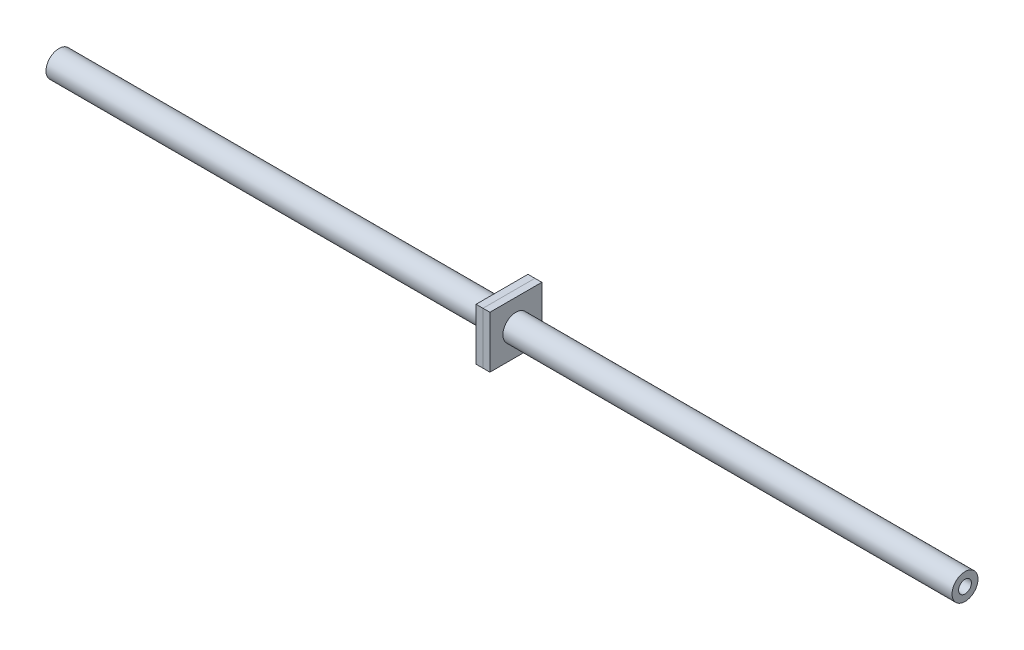
ISO-10303-21;
HEADER;
FILE_DESCRIPTION(('STEP AP214'),'2;1');
FILE_NAME('part.step','',(''),(''),'','','');
FILE_SCHEMA(('AUTOMOTIVE_DESIGN { 1 0 10303 214 1 1 1 1 }'));
ENDSEC;
DATA;
#1=APPLICATION_CONTEXT('core data for automotive mechanical design processes');
#2=APPLICATION_PROTOCOL_DEFINITION('international standard','automotive_design',2000,#1);
#3=PRODUCT_CONTEXT('',#1,'mechanical');
#4=PRODUCT('Part','Part','',(#3));
#5=PRODUCT_RELATED_PRODUCT_CATEGORY('part','',(#4));
#6=PRODUCT_DEFINITION_FORMATION('','',#4);
#7=PRODUCT_DEFINITION_CONTEXT('part definition',#1,'design');
#8=PRODUCT_DEFINITION('design','',#6,#7);
#9=PRODUCT_DEFINITION_SHAPE('','',#8);
#10=(LENGTH_UNIT() NAMED_UNIT(*) SI_UNIT(.MILLI.,.METRE.));
#11=(NAMED_UNIT(*) PLANE_ANGLE_UNIT() SI_UNIT($,.RADIAN.));
#12=(NAMED_UNIT(*) SI_UNIT($,.STERADIAN.) SOLID_ANGLE_UNIT());
#13=UNCERTAINTY_MEASURE_WITH_UNIT(LENGTH_MEASURE(1.E-05),#10,'distance_accuracy_value','');
#14=(GEOMETRIC_REPRESENTATION_CONTEXT(3) GLOBAL_UNCERTAINTY_ASSIGNED_CONTEXT((#13)) GLOBAL_UNIT_ASSIGNED_CONTEXT((#10,
#11,#12)) REPRESENTATION_CONTEXT('',''));
#15=CARTESIAN_POINT('',(0.,0.,0.));
#16=DIRECTION('',(0.,0.,1.));
#17=DIRECTION('',(1.,0.,0.));
#18=AXIS2_PLACEMENT_3D('',#15,#16,#17);
#19=CARTESIAN_POINT('',(162.56,0.,0.));
#20=DIRECTION('',(1.,0.,0.));
#21=DIRECTION('',(0.,0.,-1.));
#22=AXIS2_PLACEMENT_3D('',#19,#20,#21);
#23=PLANE('',#22);
#24=DIRECTION('',(0.,1.,0.));
#25=VECTOR('',#24,1.);
#26=CARTESIAN_POINT('',(162.56,0.,-9.525));
#27=LINE('',#26,#25);
#28=CARTESIAN_POINT('',(162.56,-9.525,-9.525));
#29=VERTEX_POINT('',#28);
#30=CARTESIAN_POINT('',(162.56,9.525,-9.525));
#31=VERTEX_POINT('',#30);
#32=EDGE_CURVE('E114',#29,#31,#27,.T.);
#33=ORIENTED_EDGE('',*,*,#32,.F.);
#34=DIRECTION('',(0.,0.,-1.));
#35=VECTOR('',#34,1.);
#36=CARTESIAN_POINT('',(162.56,-9.525,0.));
#37=LINE('',#36,#35);
#38=CARTESIAN_POINT('',(162.56,-9.525,9.525));
#39=VERTEX_POINT('',#38);
#40=EDGE_CURVE('E111',#39,#29,#37,.T.);
#41=ORIENTED_EDGE('',*,*,#40,.F.);
#42=DIRECTION('',(0.,-1.,0.));
#43=VECTOR('',#42,1.);
#44=CARTESIAN_POINT('',(162.56,0.,9.525));
#45=LINE('',#44,#43);
#46=CARTESIAN_POINT('',(162.56,9.525,9.525));
#47=VERTEX_POINT('',#46);
#48=EDGE_CURVE('E104',#47,#39,#45,.T.);
#49=ORIENTED_EDGE('',*,*,#48,.F.);
#50=DIRECTION('',(0.,0.,1.));
#51=VECTOR('',#50,1.);
#52=CARTESIAN_POINT('',(162.56,9.525,0.));
#53=LINE('',#52,#51);
#54=EDGE_CURVE('E110',#31,#47,#53,.T.);
#55=ORIENTED_EDGE('',*,*,#54,.F.);
#56=EDGE_LOOP('',(#33,#41,#49,#55));
#57=FACE_BOUND('',#56,.T.);
#58=CARTESIAN_POINT('',(162.56,0.,0.));
#59=DIRECTION('',(-1.,0.,0.));
#60=DIRECTION('',(0.,0.,1.));
#61=AXIS2_PLACEMENT_3D('',#58,#59,#60);
#62=CIRCLE('',#61,4.7625);
#63=CARTESIAN_POINT('',(162.56,0.,4.7625));
#64=VERTEX_POINT('',#63);
#65=EDGE_CURVE('E125',#64,#64,#62,.T.);
#66=ORIENTED_EDGE('',*,*,#65,.F.);
#67=EDGE_LOOP('',(#66));
#68=FACE_BOUND('',#67,.T.);
#69=ADVANCED_FACE('F55',(#57,#68),#23,.F.);
#70=CARTESIAN_POINT('',(165.1,0.,0.));
#71=DIRECTION('',(1.,0.,0.));
#72=DIRECTION('',(0.,0.,-1.));
#73=AXIS2_PLACEMENT_3D('',#70,#71,#72);
#74=PLANE('',#73);
#75=DIRECTION('',(0.,1.,0.));
#76=VECTOR('',#75,1.);
#77=CARTESIAN_POINT('',(165.1,0.,-9.525));
#78=LINE('',#77,#76);
#79=CARTESIAN_POINT('',(165.1,-9.525,-9.525));
#80=VERTEX_POINT('',#79);
#81=CARTESIAN_POINT('',(165.1,9.525,-9.525));
#82=VERTEX_POINT('',#81);
#83=EDGE_CURVE('E121',#80,#82,#78,.T.);
#84=ORIENTED_EDGE('',*,*,#83,.T.);
#85=DIRECTION('',(0.,0.,1.));
#86=VECTOR('',#85,1.);
#87=CARTESIAN_POINT('',(165.1,9.525,0.));
#88=LINE('',#87,#86);
#89=CARTESIAN_POINT('',(165.1,9.525,9.525));
#90=VERTEX_POINT('',#89);
#91=EDGE_CURVE('E124',#82,#90,#88,.T.);
#92=ORIENTED_EDGE('',*,*,#91,.T.);
#93=DIRECTION('',(0.,-1.,0.));
#94=VECTOR('',#93,1.);
#95=CARTESIAN_POINT('',(165.1,0.,9.525));
#96=LINE('',#95,#94);
#97=CARTESIAN_POINT('',(165.1,-9.525,9.525));
#98=VERTEX_POINT('',#97);
#99=EDGE_CURVE('E106',#90,#98,#96,.T.);
#100=ORIENTED_EDGE('',*,*,#99,.T.);
#101=DIRECTION('',(0.,0.,-1.));
#102=VECTOR('',#101,1.);
#103=CARTESIAN_POINT('',(165.1,-9.525,0.));
#104=LINE('',#103,#102);
#105=EDGE_CURVE('E116',#98,#80,#104,.T.);
#106=ORIENTED_EDGE('',*,*,#105,.T.);
#107=EDGE_LOOP('',(#84,#92,#100,#106));
#108=FACE_BOUND('',#107,.T.);
#109=CARTESIAN_POINT('',(165.1,0.,0.));
#110=DIRECTION('',(-1.,0.,0.));
#111=DIRECTION('',(0.,0.,1.));
#112=AXIS2_PLACEMENT_3D('',#109,#110,#111);
#113=CIRCLE('',#112,4.7625);
#114=CARTESIAN_POINT('',(165.1,0.,4.7625));
#115=VERTEX_POINT('',#114);
#116=EDGE_CURVE('E159',#115,#115,#113,.T.);
#117=ORIENTED_EDGE('',*,*,#116,.T.);
#118=EDGE_LOOP('',(#117));
#119=FACE_BOUND('',#118,.T.);
#120=ADVANCED_FACE('F131',(#108,#119),#74,.T.);
#121=CARTESIAN_POINT('',(162.56,0.,-9.525));
#122=DIRECTION('',(0.,0.,-1.));
#123=DIRECTION('',(0.,1.,0.));
#124=AXIS2_PLACEMENT_3D('',#121,#122,#123);
#125=PLANE('',#124);
#126=ORIENTED_EDGE('',*,*,#83,.F.);
#127=DIRECTION('',(1.,0.,0.));
#128=VECTOR('',#127,1.);
#129=CARTESIAN_POINT('',(162.56,-9.525,-9.525));
#130=LINE('',#129,#128);
#131=EDGE_CURVE('E13',#29,#80,#130,.T.);
#132=ORIENTED_EDGE('',*,*,#131,.F.);
#133=ORIENTED_EDGE('',*,*,#32,.T.);
#134=DIRECTION('',(1.,0.,0.));
#135=VECTOR('',#134,1.);
#136=CARTESIAN_POINT('',(162.56,9.525,-9.525));
#137=LINE('',#136,#135);
#138=EDGE_CURVE('E59',#31,#82,#137,.T.);
#139=ORIENTED_EDGE('',*,*,#138,.T.);
#140=EDGE_LOOP('',(#126,#132,#133,#139));
#141=FACE_BOUND('',#140,.T.);
#142=ADVANCED_FACE('F57',(#141),#125,.T.);
#143=CARTESIAN_POINT('',(162.56,-9.525,0.));
#144=DIRECTION('',(0.,-1.,0.));
#145=DIRECTION('',(0.,0.,-1.));
#146=AXIS2_PLACEMENT_3D('',#143,#144,#145);
#147=PLANE('',#146);
#148=ORIENTED_EDGE('',*,*,#105,.F.);
#149=DIRECTION('',(1.,0.,0.));
#150=VECTOR('',#149,1.);
#151=CARTESIAN_POINT('',(162.56,-9.525,9.525));
#152=LINE('',#151,#150);
#153=EDGE_CURVE('E65',#39,#98,#152,.T.);
#154=ORIENTED_EDGE('',*,*,#153,.F.);
#155=ORIENTED_EDGE('',*,*,#40,.T.);
#156=ORIENTED_EDGE('',*,*,#131,.T.);
#157=EDGE_LOOP('',(#148,#154,#155,#156));
#158=FACE_BOUND('',#157,.T.);
#159=ADVANCED_FACE('F133',(#158),#147,.T.);
#160=CARTESIAN_POINT('',(162.56,0.,9.525));
#161=DIRECTION('',(0.,0.,1.));
#162=DIRECTION('',(0.,-1.,0.));
#163=AXIS2_PLACEMENT_3D('',#160,#161,#162);
#164=PLANE('',#163);
#165=ORIENTED_EDGE('',*,*,#99,.F.);
#166=DIRECTION('',(1.,0.,0.));
#167=VECTOR('',#166,1.);
#168=CARTESIAN_POINT('',(162.56,9.525,9.525));
#169=LINE('',#168,#167);
#170=EDGE_CURVE('E101',#47,#90,#169,.T.);
#171=ORIENTED_EDGE('',*,*,#170,.F.);
#172=ORIENTED_EDGE('',*,*,#48,.T.);
#173=ORIENTED_EDGE('',*,*,#153,.T.);
#174=EDGE_LOOP('',(#165,#171,#172,#173));
#175=FACE_BOUND('',#174,.T.);
#176=ADVANCED_FACE('F103',(#175),#164,.T.);
#177=CARTESIAN_POINT('',(162.56,9.525,0.));
#178=DIRECTION('',(0.,1.,0.));
#179=DIRECTION('',(0.,0.,1.));
#180=AXIS2_PLACEMENT_3D('',#177,#178,#179);
#181=PLANE('',#180);
#182=ORIENTED_EDGE('',*,*,#91,.F.);
#183=ORIENTED_EDGE('',*,*,#138,.F.);
#184=ORIENTED_EDGE('',*,*,#54,.T.);
#185=ORIENTED_EDGE('',*,*,#170,.T.);
#186=EDGE_LOOP('',(#182,#183,#184,#185));
#187=FACE_BOUND('',#186,.T.);
#188=ADVANCED_FACE('F113',(#187),#181,.T.);
#189=CARTESIAN_POINT('',(162.56,0.,0.));
#190=DIRECTION('',(1.,0.,0.));
#191=DIRECTION('',(0.,0.,-1.));
#192=AXIS2_PLACEMENT_3D('',#189,#190,#191);
#193=CYLINDRICAL_SURFACE('',#192,4.7625);
#194=ORIENTED_EDGE('',*,*,#65,.T.);
#195=EDGE_LOOP('',(#194));
#196=FACE_BOUND('',#195,.T.);
#197=ORIENTED_EDGE('',*,*,#116,.F.);
#198=EDGE_LOOP('',(#197));
#199=FACE_BOUND('',#198,.T.);
#200=ADVANCED_FACE('F148',(#196,#199),#193,.F.);
#201=CLOSED_SHELL('',(#69,#120,#142,#159,#176,#188,#200));
#202=MANIFOLD_SOLID_BREP('B2',#201);
#203=CARTESIAN_POINT('',(167.64,0.,0.));
#204=DIRECTION('',(-1.,0.,0.));
#205=DIRECTION('',(0.,0.,1.));
#206=AXIS2_PLACEMENT_3D('',#203,#204,#205);
#207=PLANE('',#206);
#208=DIRECTION('',(0.,-1.,0.));
#209=VECTOR('',#208,1.);
#210=CARTESIAN_POINT('',(167.64,9.525,9.525));
#211=LINE('',#210,#209);
#212=CARTESIAN_POINT('',(167.64,9.525,9.525));
#213=VERTEX_POINT('',#212);
#214=CARTESIAN_POINT('',(167.64,-9.525,9.525));
#215=VERTEX_POINT('',#214);
#216=EDGE_CURVE('E259',#213,#215,#211,.T.);
#217=ORIENTED_EDGE('',*,*,#216,.T.);
#218=DIRECTION('',(0.,0.,-1.));
#219=VECTOR('',#218,1.);
#220=CARTESIAN_POINT('',(167.64,-9.525,-9.525));
#221=LINE('',#220,#219);
#222=CARTESIAN_POINT('',(167.64,-9.525,-9.525));
#223=VERTEX_POINT('',#222);
#224=EDGE_CURVE('E254',#215,#223,#221,.T.);
#225=ORIENTED_EDGE('',*,*,#224,.T.);
#226=DIRECTION('',(0.,1.,0.));
#227=VECTOR('',#226,1.);
#228=CARTESIAN_POINT('',(167.64,9.525,-9.525));
#229=LINE('',#228,#227);
#230=CARTESIAN_POINT('',(167.64,9.525,-9.525));
#231=VERTEX_POINT('',#230);
#232=EDGE_CURVE('E257',#223,#231,#229,.T.);
#233=ORIENTED_EDGE('',*,*,#232,.T.);
#234=DIRECTION('',(0.,0.,1.));
#235=VECTOR('',#234,1.);
#236=CARTESIAN_POINT('',(167.64,9.525,-9.525));
#237=LINE('',#236,#235);
#238=EDGE_CURVE('E224',#231,#213,#237,.T.);
#239=ORIENTED_EDGE('',*,*,#238,.T.);
#240=EDGE_LOOP('',(#217,#225,#233,#239));
#241=FACE_BOUND('',#240,.T.);
#242=CARTESIAN_POINT('',(167.64,0.,0.));
#243=DIRECTION('',(1.,0.,0.));
#244=DIRECTION('',(0.,0.,-1.));
#245=AXIS2_PLACEMENT_3D('',#242,#243,#244);
#246=CIRCLE('',#245,4.7625);
#247=CARTESIAN_POINT('',(167.64,0.,-4.7625));
#248=VERTEX_POINT('',#247);
#249=EDGE_CURVE('E274',#248,#248,#246,.T.);
#250=ORIENTED_EDGE('',*,*,#249,.F.);
#251=EDGE_LOOP('',(#250));
#252=FACE_BOUND('',#251,.T.);
#253=ADVANCED_FACE('F207',(#241,#252),#207,.F.);
#254=CARTESIAN_POINT('',(165.1,0.,0.));
#255=DIRECTION('',(-1.,0.,0.));
#256=DIRECTION('',(0.,0.,1.));
#257=AXIS2_PLACEMENT_3D('',#254,#255,#256);
#258=PLANE('',#257);
#259=DIRECTION('',(0.,-1.,0.));
#260=VECTOR('',#259,1.);
#261=CARTESIAN_POINT('',(165.1,9.525,9.525));
#262=LINE('',#261,#260);
#263=CARTESIAN_POINT('',(165.1,9.525,9.525));
#264=VERTEX_POINT('',#263);
#265=CARTESIAN_POINT('',(165.1,-9.525,9.525));
#266=VERTEX_POINT('',#265);
#267=EDGE_CURVE('E271',#264,#266,#262,.T.);
#268=ORIENTED_EDGE('',*,*,#267,.F.);
#269=DIRECTION('',(0.,0.,1.));
#270=VECTOR('',#269,1.);
#271=CARTESIAN_POINT('',(165.1,9.525,-9.525));
#272=LINE('',#271,#270);
#273=CARTESIAN_POINT('',(165.1,9.525,-9.525));
#274=VERTEX_POINT('',#273);
#275=EDGE_CURVE('E247',#274,#264,#272,.T.);
#276=ORIENTED_EDGE('',*,*,#275,.F.);
#277=DIRECTION('',(0.,1.,0.));
#278=VECTOR('',#277,1.);
#279=CARTESIAN_POINT('',(165.1,9.525,-9.525));
#280=LINE('',#279,#278);
#281=CARTESIAN_POINT('',(165.1,-9.525,-9.525));
#282=VERTEX_POINT('',#281);
#283=EDGE_CURVE('E241',#282,#274,#280,.T.);
#284=ORIENTED_EDGE('',*,*,#283,.F.);
#285=DIRECTION('',(0.,0.,-1.));
#286=VECTOR('',#285,1.);
#287=CARTESIAN_POINT('',(165.1,-9.525,-9.525));
#288=LINE('',#287,#286);
#289=EDGE_CURVE('E263',#266,#282,#288,.T.);
#290=ORIENTED_EDGE('',*,*,#289,.F.);
#291=EDGE_LOOP('',(#268,#276,#284,#290));
#292=FACE_BOUND('',#291,.T.);
#293=CARTESIAN_POINT('',(165.1,0.,0.));
#294=DIRECTION('',(1.,0.,0.));
#295=DIRECTION('',(0.,0.,-1.));
#296=AXIS2_PLACEMENT_3D('',#293,#294,#295);
#297=CIRCLE('',#296,4.7625);
#298=CARTESIAN_POINT('',(165.1,0.,-4.7625));
#299=VERTEX_POINT('',#298);
#300=EDGE_CURVE('E286',#299,#299,#297,.T.);
#301=ORIENTED_EDGE('',*,*,#300,.T.);
#302=EDGE_LOOP('',(#301));
#303=FACE_BOUND('',#302,.T.);
#304=ADVANCED_FACE('F282',(#292,#303),#258,.T.);
#305=CARTESIAN_POINT('',(167.64,9.525,9.525));
#306=DIRECTION('',(0.,0.,-1.));
#307=DIRECTION('',(0.,1.,0.));
#308=AXIS2_PLACEMENT_3D('',#305,#306,#307);
#309=PLANE('',#308);
#310=ORIENTED_EDGE('',*,*,#267,.T.);
#311=DIRECTION('',(-1.,0.,0.));
#312=VECTOR('',#311,1.);
#313=CARTESIAN_POINT('',(167.64,-9.525,9.525));
#314=LINE('',#313,#312);
#315=EDGE_CURVE('E53',#215,#266,#314,.T.);
#316=ORIENTED_EDGE('',*,*,#315,.F.);
#317=ORIENTED_EDGE('',*,*,#216,.F.);
#318=DIRECTION('',(-1.,0.,0.));
#319=VECTOR('',#318,1.);
#320=CARTESIAN_POINT('',(167.64,9.525,9.525));
#321=LINE('',#320,#319);
#322=EDGE_CURVE('E267',#213,#264,#321,.T.);
#323=ORIENTED_EDGE('',*,*,#322,.T.);
#324=EDGE_LOOP('',(#310,#316,#317,#323));
#325=FACE_BOUND('',#324,.T.);
#326=ADVANCED_FACE('F209',(#325),#309,.F.);
#327=CARTESIAN_POINT('',(167.64,-9.525,-9.525));
#328=DIRECTION('',(0.,1.,0.));
#329=DIRECTION('',(0.,0.,1.));
#330=AXIS2_PLACEMENT_3D('',#327,#328,#329);
#331=PLANE('',#330);
#332=ORIENTED_EDGE('',*,*,#289,.T.);
#333=DIRECTION('',(-1.,0.,0.));
#334=VECTOR('',#333,1.);
#335=CARTESIAN_POINT('',(167.64,-9.525,-9.525));
#336=LINE('',#335,#334);
#337=EDGE_CURVE('E216',#223,#282,#336,.T.);
#338=ORIENTED_EDGE('',*,*,#337,.F.);
#339=ORIENTED_EDGE('',*,*,#224,.F.);
#340=ORIENTED_EDGE('',*,*,#315,.T.);
#341=EDGE_LOOP('',(#332,#338,#339,#340));
#342=FACE_BOUND('',#341,.T.);
#343=ADVANCED_FACE('F262',(#342),#331,.F.);
#344=CARTESIAN_POINT('',(167.64,9.525,-9.525));
#345=DIRECTION('',(0.,0.,1.));
#346=DIRECTION('',(0.,-1.,0.));
#347=AXIS2_PLACEMENT_3D('',#344,#345,#346);
#348=PLANE('',#347);
#349=ORIENTED_EDGE('',*,*,#283,.T.);
#350=DIRECTION('',(-1.,0.,0.));
#351=VECTOR('',#350,1.);
#352=CARTESIAN_POINT('',(167.64,9.525,-9.525));
#353=LINE('',#352,#351);
#354=EDGE_CURVE('E264',#231,#274,#353,.T.);
#355=ORIENTED_EDGE('',*,*,#354,.F.);
#356=ORIENTED_EDGE('',*,*,#232,.F.);
#357=ORIENTED_EDGE('',*,*,#337,.T.);
#358=EDGE_LOOP('',(#349,#355,#356,#357));
#359=FACE_BOUND('',#358,.T.);
#360=ADVANCED_FACE('F265',(#359),#348,.F.);
#361=CARTESIAN_POINT('',(167.64,9.525,-9.525));
#362=DIRECTION('',(0.,-1.,0.));
#363=DIRECTION('',(0.,0.,-1.));
#364=AXIS2_PLACEMENT_3D('',#361,#362,#363);
#365=PLANE('',#364);
#366=ORIENTED_EDGE('',*,*,#275,.T.);
#367=ORIENTED_EDGE('',*,*,#322,.F.);
#368=ORIENTED_EDGE('',*,*,#238,.F.);
#369=ORIENTED_EDGE('',*,*,#354,.T.);
#370=EDGE_LOOP('',(#366,#367,#368,#369));
#371=FACE_BOUND('',#370,.T.);
#372=ADVANCED_FACE('F279',(#371),#365,.F.);
#373=CARTESIAN_POINT('',(167.64,0.,0.));
#374=DIRECTION('',(-1.,0.,0.));
#375=DIRECTION('',(0.,0.,1.));
#376=AXIS2_PLACEMENT_3D('',#373,#374,#375);
#377=CYLINDRICAL_SURFACE('',#376,4.7625);
#378=ORIENTED_EDGE('',*,*,#249,.T.);
#379=EDGE_LOOP('',(#378));
#380=FACE_BOUND('',#379,.T.);
#381=ORIENTED_EDGE('',*,*,#300,.F.);
#382=EDGE_LOOP('',(#381));
#383=FACE_BOUND('',#382,.T.);
#384=ADVANCED_FACE('F292',(#380,#383),#377,.F.);
#385=CLOSED_SHELL('',(#253,#304,#326,#343,#360,#372,#384));
#386=MANIFOLD_SOLID_BREP('B7',#385);
#387=CARTESIAN_POINT('',(332.4405,0.,0.));
#388=DIRECTION('',(-1.,0.,0.));
#389=DIRECTION('',(0.,0.,1.));
#390=AXIS2_PLACEMENT_3D('',#387,#388,#389);
#391=CYLINDRICAL_SURFACE('',#390,2.3495);
#392=CARTESIAN_POINT('',(332.4405,0.,0.));
#393=DIRECTION('',(1.,0.,0.));
#394=DIRECTION('',(0.,0.,-1.));
#395=AXIS2_PLACEMENT_3D('',#392,#393,#394);
#396=CIRCLE('',#395,2.3495);
#397=CARTESIAN_POINT('',(332.4405,0.,-2.3495));
#398=VERTEX_POINT('',#397);
#399=EDGE_CURVE('E344',#398,#398,#396,.T.);
#400=ORIENTED_EDGE('',*,*,#399,.T.);
#401=EDGE_LOOP('',(#400));
#402=FACE_BOUND('',#401,.T.);
#403=CARTESIAN_POINT('',(0.,0.,0.));
#404=DIRECTION('',(1.,0.,0.));
#405=DIRECTION('',(0.,0.,-1.));
#406=AXIS2_PLACEMENT_3D('',#403,#404,#405);
#407=CIRCLE('',#406,2.3495);
#408=CARTESIAN_POINT('',(0.,0.,-2.3495));
#409=VERTEX_POINT('',#408);
#410=EDGE_CURVE('E350',#409,#409,#407,.T.);
#411=ORIENTED_EDGE('',*,*,#410,.F.);
#412=EDGE_LOOP('',(#411));
#413=FACE_BOUND('',#412,.T.);
#414=ADVANCED_FACE('F337',(#402,#413),#391,.F.);
#415=CARTESIAN_POINT('',(332.4405,0.,0.));
#416=DIRECTION('',(-1.,0.,0.));
#417=DIRECTION('',(0.,0.,1.));
#418=AXIS2_PLACEMENT_3D('',#415,#416,#417);
#419=CYLINDRICAL_SURFACE('',#418,4.7625);
#420=CARTESIAN_POINT('',(332.4405,0.,0.));
#421=DIRECTION('',(1.,0.,0.));
#422=DIRECTION('',(0.,0.,-1.));
#423=AXIS2_PLACEMENT_3D('',#420,#421,#422);
#424=CIRCLE('',#423,4.7625);
#425=CARTESIAN_POINT('',(332.4405,0.,-4.7625));
#426=VERTEX_POINT('',#425);
#427=EDGE_CURVE('E206',#426,#426,#424,.T.);
#428=ORIENTED_EDGE('',*,*,#427,.F.);
#429=EDGE_LOOP('',(#428));
#430=FACE_BOUND('',#429,.T.);
#431=CARTESIAN_POINT('',(0.,0.,0.));
#432=DIRECTION('',(1.,0.,0.));
#433=DIRECTION('',(0.,0.,-1.));
#434=AXIS2_PLACEMENT_3D('',#431,#432,#433);
#435=CIRCLE('',#434,4.7625);
#436=CARTESIAN_POINT('',(0.,0.,-4.7625));
#437=VERTEX_POINT('',#436);
#438=EDGE_CURVE('E340',#437,#437,#435,.T.);
#439=ORIENTED_EDGE('',*,*,#438,.T.);
#440=EDGE_LOOP('',(#439));
#441=FACE_BOUND('',#440,.T.);
#442=ADVANCED_FACE('F357',(#430,#441),#419,.T.);
#443=CARTESIAN_POINT('',(332.4405,0.,0.));
#444=DIRECTION('',(1.,0.,0.));
#445=DIRECTION('',(0.,0.,-1.));
#446=AXIS2_PLACEMENT_3D('',#443,#444,#445);
#447=PLANE('',#446);
#448=ORIENTED_EDGE('',*,*,#399,.F.);
#449=EDGE_LOOP('',(#448));
#450=FACE_BOUND('',#449,.T.);
#451=ORIENTED_EDGE('',*,*,#427,.T.);
#452=EDGE_LOOP('',(#451));
#453=FACE_BOUND('',#452,.T.);
#454=ADVANCED_FACE('F361',(#450,#453),#447,.T.);
#455=CARTESIAN_POINT('',(0.,0.,0.));
#456=DIRECTION('',(1.,0.,0.));
#457=DIRECTION('',(0.,0.,-1.));
#458=AXIS2_PLACEMENT_3D('',#455,#456,#457);
#459=PLANE('',#458);
#460=ORIENTED_EDGE('',*,*,#410,.T.);
#461=EDGE_LOOP('',(#460));
#462=FACE_BOUND('',#461,.T.);
#463=ORIENTED_EDGE('',*,*,#438,.F.);
#464=EDGE_LOOP('',(#463));
#465=FACE_BOUND('',#464,.T.);
#466=ADVANCED_FACE('F359',(#462,#465),#459,.F.);
#467=CLOSED_SHELL('',(#414,#442,#454,#466));
#468=MANIFOLD_SOLID_BREP('B47',#467);
#469=ADVANCED_BREP_SHAPE_REPRESENTATION('',(#18,#202,#386,#468),#14);
#470=SHAPE_DEFINITION_REPRESENTATION(#9,#469);
ENDSEC;
END-ISO-10303-21;
